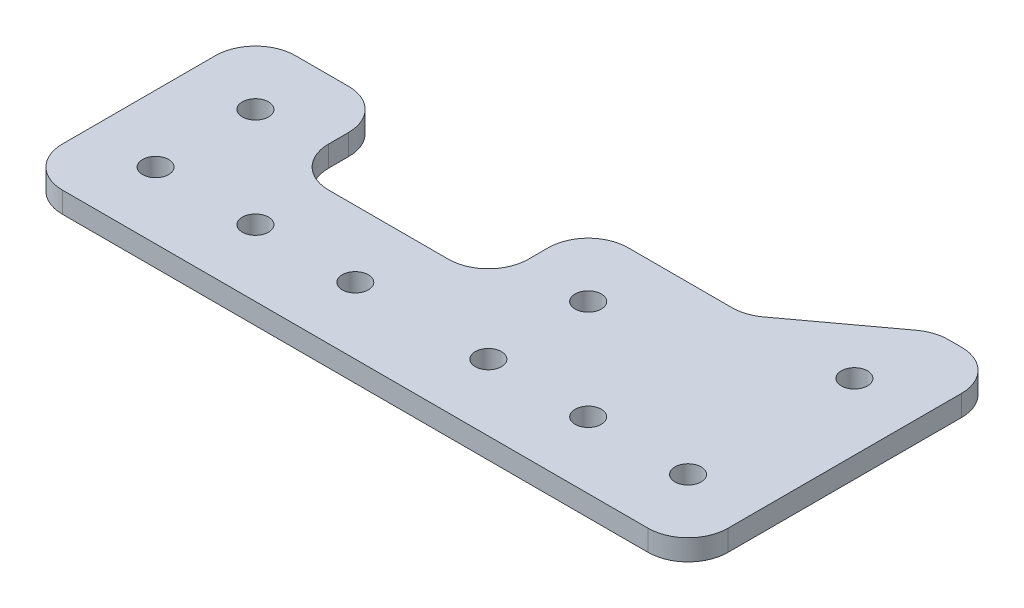
ISO-10303-21;
HEADER;
FILE_DESCRIPTION(('STEP AP214'),'2;1');
FILE_NAME('part.step','',(''),(''),'','','');
FILE_SCHEMA(('AUTOMOTIVE_DESIGN { 1 0 10303 214 1 1 1 1 }'));
ENDSEC;
DATA;
#1=APPLICATION_CONTEXT('core data for automotive mechanical design processes');
#2=APPLICATION_PROTOCOL_DEFINITION('international standard','automotive_design',2000,#1);
#3=PRODUCT_CONTEXT('',#1,'mechanical');
#4=PRODUCT('Part','Part','',(#3));
#5=PRODUCT_RELATED_PRODUCT_CATEGORY('part','',(#4));
#6=PRODUCT_DEFINITION_FORMATION('','',#4);
#7=PRODUCT_DEFINITION_CONTEXT('part definition',#1,'design');
#8=PRODUCT_DEFINITION('design','',#6,#7);
#9=PRODUCT_DEFINITION_SHAPE('','',#8);
#10=(LENGTH_UNIT() NAMED_UNIT(*) SI_UNIT(.MILLI.,.METRE.));
#11=(NAMED_UNIT(*) PLANE_ANGLE_UNIT() SI_UNIT($,.RADIAN.));
#12=(NAMED_UNIT(*) SI_UNIT($,.STERADIAN.) SOLID_ANGLE_UNIT());
#13=UNCERTAINTY_MEASURE_WITH_UNIT(LENGTH_MEASURE(1.E-05),#10,'distance_accuracy_value','');
#14=(GEOMETRIC_REPRESENTATION_CONTEXT(3) GLOBAL_UNCERTAINTY_ASSIGNED_CONTEXT((#13)) GLOBAL_UNIT_ASSIGNED_CONTEXT((#10,
#11,#12)) REPRESENTATION_CONTEXT('',''));
#15=CARTESIAN_POINT('',(0.,0.,0.));
#16=DIRECTION('',(0.,0.,1.));
#17=DIRECTION('',(1.,0.,0.));
#18=AXIS2_PLACEMENT_3D('',#15,#16,#17);
#19=CARTESIAN_POINT('',(1.00323177257206E-12,29.3999999999989,304.8));
#20=DIRECTION('',(0.,0.,-1.));
#21=DIRECTION('',(-1.,0.,0.));
#22=AXIS2_PLACEMENT_3D('',#19,#20,#21);
#23=PLANE('',#22);
#24=DIRECTION('',(1.,0.,0.));
#25=VECTOR('',#24,1.);
#26=CARTESIAN_POINT('',(1.01719769792743E-12,25.3999999999989,304.8));
#27=LINE('',#26,#25);
#28=CARTESIAN_POINT('',(-182.879999999999,25.3999999999983,304.800000000001));
#29=VERTEX_POINT('',#28);
#30=CARTESIAN_POINT('',(-71.119999999999,25.3999999999987,304.8));
#31=VERTEX_POINT('',#30);
#32=EDGE_CURVE('E366',#29,#31,#27,.T.);
#33=ORIENTED_EDGE('',*,*,#32,.T.);
#34=DIRECTION('',(0.,-1.,0.));
#35=VECTOR('',#34,1.);
#36=CARTESIAN_POINT('',(-71.119999999999,29.3999999999987,304.8));
#37=LINE('',#36,#35);
#38=CARTESIAN_POINT('',(-71.119999999999,29.3999999999987,304.8));
#39=VERTEX_POINT('',#38);
#40=EDGE_CURVE('E184',#31,#39,#37,.F.);
#41=ORIENTED_EDGE('',*,*,#40,.T.);
#42=DIRECTION('',(1.,0.,0.));
#43=VECTOR('',#42,1.);
#44=CARTESIAN_POINT('',(1.00323177257206E-12,29.3999999999989,304.8));
#45=LINE('',#44,#43);
#46=CARTESIAN_POINT('',(-182.879999999999,29.3999999999983,304.800000000001));
#47=VERTEX_POINT('',#46);
#48=EDGE_CURVE('E476',#47,#39,#45,.T.);
#49=ORIENTED_EDGE('',*,*,#48,.F.);
#50=DIRECTION('',(0.,-1.,0.));
#51=VECTOR('',#50,1.);
#52=CARTESIAN_POINT('',(-182.879999999999,29.3999999999983,304.800000000001));
#53=LINE('',#52,#51);
#54=EDGE_CURVE('E287',#47,#29,#53,.T.);
#55=ORIENTED_EDGE('',*,*,#54,.T.);
#56=EDGE_LOOP('',(#33,#41,#49,#55));
#57=FACE_BOUND('',#56,.T.);
#58=ADVANCED_FACE('F35',(#57),#23,.F.);
#59=CARTESIAN_POINT('',(-63.4999999999991,29.3999999999998,1.02605102930766E-13));
#60=DIRECTION('',(-1.,0.,0.));
#61=DIRECTION('',(0.,-1.,0.));
#62=AXIS2_PLACEMENT_3D('',#59,#60,#61);
#63=PLANE('',#62);
#64=DIRECTION('',(0.,0.,-1.));
#65=VECTOR('',#64,1.);
#66=CARTESIAN_POINT('',(-63.4999999999991,25.3999999999998,0.));
#67=LINE('',#66,#65);
#68=CARTESIAN_POINT('',(-63.4999999999991,25.3999999999987,297.18));
#69=VERTEX_POINT('',#68);
#70=CARTESIAN_POINT('',(-63.4999999999991,25.3999999999989,252.604139980439));
#71=VERTEX_POINT('',#70);
#72=EDGE_CURVE('E369',#69,#71,#67,.T.);
#73=ORIENTED_EDGE('',*,*,#72,.T.);
#74=DIRECTION('',(0.,-1.,0.));
#75=VECTOR('',#74,1.);
#76=CARTESIAN_POINT('',(-63.4999999999991,29.3999999999989,252.604139980439));
#77=LINE('',#76,#75);
#78=CARTESIAN_POINT('',(-63.4999999999991,29.3999999999989,252.604139980439));
#79=VERTEX_POINT('',#78);
#80=EDGE_CURVE('E271',#71,#79,#77,.F.);
#81=ORIENTED_EDGE('',*,*,#80,.T.);
#82=DIRECTION('',(0.,0.,-1.));
#83=VECTOR('',#82,1.);
#84=CARTESIAN_POINT('',(-63.4999999999991,29.3999999999998,1.02605102930766E-13));
#85=LINE('',#84,#83);
#86=CARTESIAN_POINT('',(-63.4999999999991,29.3999999999987,297.18));
#87=VERTEX_POINT('',#86);
#88=EDGE_CURVE('E473',#87,#79,#85,.T.);
#89=ORIENTED_EDGE('',*,*,#88,.F.);
#90=DIRECTION('',(0.,-1.,0.));
#91=VECTOR('',#90,1.);
#92=CARTESIAN_POINT('',(-63.4999999999991,29.3999999999987,297.18));
#93=LINE('',#92,#91);
#94=EDGE_CURVE('E268',#87,#69,#93,.T.);
#95=ORIENTED_EDGE('',*,*,#94,.T.);
#96=EDGE_LOOP('',(#73,#81,#89,#95));
#97=FACE_BOUND('',#96,.T.);
#98=ADVANCED_FACE('F398',(#97),#63,.F.);
#99=CARTESIAN_POINT('',(-1.02605102930764E-13,29.3999999999991,244.984139980439));
#100=DIRECTION('',(0.,0.,-1.));
#101=DIRECTION('',(0.,1.,0.));
#102=AXIS2_PLACEMENT_3D('',#99,#100,#101);
#103=PLANE('',#102);
#104=DIRECTION('',(1.,0.,0.));
#105=VECTOR('',#104,1.);
#106=CARTESIAN_POINT('',(0.,25.3999999999991,244.984139980439));
#107=LINE('',#106,#105);
#108=CARTESIAN_POINT('',(-73.6941096602435,25.3999999999989,244.984139980439));
#109=VERTEX_POINT('',#108);
#110=CARTESIAN_POINT('',(-71.1199999999991,25.3999999999989,244.984139980439));
#111=VERTEX_POINT('',#110);
#112=EDGE_CURVE('E308',#109,#111,#107,.T.);
#113=ORIENTED_EDGE('',*,*,#112,.F.);
#114=DIRECTION('',(0.,-1.,0.));
#115=VECTOR('',#114,1.);
#116=CARTESIAN_POINT('',(-73.6941096602435,29.3999999999989,244.984139980439));
#117=LINE('',#116,#115);
#118=CARTESIAN_POINT('',(-73.6941096602435,29.3999999999989,244.984139980439));
#119=VERTEX_POINT('',#118);
#120=EDGE_CURVE('E253',#109,#119,#117,.F.);
#121=ORIENTED_EDGE('',*,*,#120,.T.);
#122=DIRECTION('',(1.,0.,0.));
#123=VECTOR('',#122,1.);
#124=CARTESIAN_POINT('',(-1.02605102930764E-13,29.3999999999991,244.984139980439));
#125=LINE('',#124,#123);
#126=CARTESIAN_POINT('',(-71.1199999999991,29.3999999999989,244.984139980439));
#127=VERTEX_POINT('',#126);
#128=EDGE_CURVE('E328',#119,#127,#125,.T.);
#129=ORIENTED_EDGE('',*,*,#128,.T.);
#130=DIRECTION('',(0.,-1.,0.));
#131=VECTOR('',#130,1.);
#132=CARTESIAN_POINT('',(-71.1199999999991,25.3999999999989,244.984139980439));
#133=LINE('',#132,#131);
#134=EDGE_CURVE('E250',#127,#111,#133,.T.);
#135=ORIENTED_EDGE('',*,*,#134,.T.);
#136=EDGE_LOOP('',(#113,#121,#129,#135));
#137=FACE_BOUND('',#136,.T.);
#138=ADVANCED_FACE('F404',(#137),#103,.T.);
#139=CARTESIAN_POINT('',(90.1804497914189,29.3999999999999,122.283715004447));
#140=DIRECTION('',(-0.593525988522105,0.,-0.804814824011622));
#141=DIRECTION('',(-0.804814824011622,0.,0.593525988522105));
#142=AXIS2_PLACEMENT_3D('',#139,#140,#141);
#143=PLANE('',#142);
#144=DIRECTION('',(0.804814824011622,0.,-0.593525988522106));
#145=VECTOR('',#144,1.);
#146=CARTESIAN_POINT('',(90.1804497914189,29.3999999999999,122.283715004447));
#147=LINE('',#146,#145);
#148=CARTESIAN_POINT('',(-95.0191623782209,29.3999999999988,258.862688958968));
#149=VERTEX_POINT('',#148);
#150=CARTESIAN_POINT('',(-78.216777692782,29.3999999999989,246.47145102147));
#151=VERTEX_POINT('',#150);
#152=EDGE_CURVE('E319',#149,#151,#147,.T.);
#153=ORIENTED_EDGE('',*,*,#152,.T.);
#154=DIRECTION('',(0.,-1.,0.));
#155=VECTOR('',#154,1.);
#156=CARTESIAN_POINT('',(-78.216777692782,29.3999999999989,246.47145102147));
#157=LINE('',#156,#155);
#158=CARTESIAN_POINT('',(-78.216777692782,25.3999999999989,246.47145102147));
#159=VERTEX_POINT('',#158);
#160=EDGE_CURVE('E234',#151,#159,#157,.T.);
#161=ORIENTED_EDGE('',*,*,#160,.T.);
#162=DIRECTION('',(0.804814824011622,0.,-0.593525988522106));
#163=VECTOR('',#162,1.);
#164=CARTESIAN_POINT('',(90.1804497914189,25.3999999999999,122.283715004447));
#165=LINE('',#164,#163);
#166=CARTESIAN_POINT('',(-95.0191623782209,25.3999999999988,258.862688958968));
#167=VERTEX_POINT('',#166);
#168=EDGE_CURVE('E297',#167,#159,#165,.T.);
#169=ORIENTED_EDGE('',*,*,#168,.F.);
#170=DIRECTION('',(0.,-1.,0.));
#171=VECTOR('',#170,1.);
#172=CARTESIAN_POINT('',(-95.0191623782209,29.3999999999987,258.862688958968));
#173=LINE('',#172,#171);
#174=EDGE_CURVE('E232',#167,#149,#173,.F.);
#175=ORIENTED_EDGE('',*,*,#174,.T.);
#176=EDGE_LOOP('',(#153,#161,#169,#175));
#177=FACE_BOUND('',#176,.T.);
#178=ADVANCED_FACE('F305',(#177),#143,.T.);
#179=CARTESIAN_POINT('',(3.79716994185066E-13,29.3999999999991,260.35));
#180=DIRECTION('',(0.,0.,-1.));
#181=DIRECTION('',(0.,1.,0.));
#182=AXIS2_PLACEMENT_3D('',#179,#180,#181);
#183=PLANE('',#182);
#184=DIRECTION('',(1.,0.,0.));
#185=VECTOR('',#184,1.);
#186=CARTESIAN_POINT('',(3.79716994185066E-13,29.3999999999991,260.35));
#187=LINE('',#186,#185);
#188=CARTESIAN_POINT('',(-119.38,29.3999999999987,260.35));
#189=VERTEX_POINT('',#188);
#190=CARTESIAN_POINT('',(-99.5418304107593,29.3999999999987,260.35));
#191=VERTEX_POINT('',#190);
#192=EDGE_CURVE('E317',#189,#191,#187,.T.);
#193=ORIENTED_EDGE('',*,*,#192,.T.);
#194=DIRECTION('',(0.,-1.,0.));
#195=VECTOR('',#194,1.);
#196=CARTESIAN_POINT('',(-99.5418304107593,25.3999999999987,260.35));
#197=LINE('',#196,#195);
#198=CARTESIAN_POINT('',(-99.5418304107593,25.3999999999987,260.35));
#199=VERTEX_POINT('',#198);
#200=EDGE_CURVE('E275',#191,#199,#197,.T.);
#201=ORIENTED_EDGE('',*,*,#200,.T.);
#202=DIRECTION('',(1.,0.,0.));
#203=VECTOR('',#202,1.);
#204=CARTESIAN_POINT('',(3.93682919540439E-13,25.3999999999991,260.35));
#205=LINE('',#204,#203);
#206=CARTESIAN_POINT('',(-119.38,25.3999999999987,260.35));
#207=VERTEX_POINT('',#206);
#208=EDGE_CURVE('E299',#207,#199,#205,.T.);
#209=ORIENTED_EDGE('',*,*,#208,.F.);
#210=DIRECTION('',(0.,-1.,0.));
#211=VECTOR('',#210,1.);
#212=CARTESIAN_POINT('',(-119.38,29.3999999999987,260.35));
#213=LINE('',#212,#211);
#214=EDGE_CURVE('E273',#207,#189,#213,.F.);
#215=ORIENTED_EDGE('',*,*,#214,.T.);
#216=EDGE_LOOP('',(#193,#201,#209,#215));
#217=FACE_BOUND('',#216,.T.);
#218=ADVANCED_FACE('F321',(#217),#183,.T.);
#219=CARTESIAN_POINT('',(-127.,29.3999999999995,0.));
#220=DIRECTION('',(1.,0.,0.));
#221=DIRECTION('',(0.,1.,0.));
#222=AXIS2_PLACEMENT_3D('',#219,#220,#221);
#223=PLANE('',#222);
#224=DIRECTION('',(0.,0.,1.));
#225=VECTOR('',#224,1.);
#226=CARTESIAN_POINT('',(-127.,25.3999999999995,0.));
#227=LINE('',#226,#225);
#228=CARTESIAN_POINT('',(-127.,25.3999999999986,267.97));
#229=VERTEX_POINT('',#228);
#230=CARTESIAN_POINT('',(-127.,25.3999999999986,271.78));
#231=VERTEX_POINT('',#230);
#232=EDGE_CURVE('E207',#229,#231,#227,.T.);
#233=ORIENTED_EDGE('',*,*,#232,.T.);
#234=DIRECTION('',(0.,-1.,0.));
#235=VECTOR('',#234,1.);
#236=CARTESIAN_POINT('',(-127.,29.3999999999986,271.78));
#237=LINE('',#236,#235);
#238=CARTESIAN_POINT('',(-127.,29.3999999999986,271.78));
#239=VERTEX_POINT('',#238);
#240=EDGE_CURVE('E230',#231,#239,#237,.F.);
#241=ORIENTED_EDGE('',*,*,#240,.T.);
#242=DIRECTION('',(0.,0.,1.));
#243=VECTOR('',#242,1.);
#244=CARTESIAN_POINT('',(-127.,29.3999999999995,0.));
#245=LINE('',#244,#243);
#246=CARTESIAN_POINT('',(-127.,29.3999999999986,267.97));
#247=VERTEX_POINT('',#246);
#248=EDGE_CURVE('E323',#247,#239,#245,.T.);
#249=ORIENTED_EDGE('',*,*,#248,.F.);
#250=DIRECTION('',(0.,-1.,0.));
#251=VECTOR('',#250,1.);
#252=CARTESIAN_POINT('',(-127.,25.3999999999986,267.97));
#253=LINE('',#252,#251);
#254=EDGE_CURVE('E227',#247,#229,#253,.T.);
#255=ORIENTED_EDGE('',*,*,#254,.T.);
#256=EDGE_LOOP('',(#233,#241,#249,#255));
#257=FACE_BOUND('',#256,.T.);
#258=ADVANCED_FACE('F378',(#257),#223,.F.);
#259=CARTESIAN_POINT('',(9.11078699613493E-13,29.399999999999,279.4));
#260=DIRECTION('',(0.,0.,1.));
#261=DIRECTION('',(1.,0.,0.));
#262=AXIS2_PLACEMENT_3D('',#259,#260,#261);
#263=PLANE('',#262);
#264=DIRECTION('',(-1.,0.,0.));
#265=VECTOR('',#264,1.);
#266=CARTESIAN_POINT('',(9.25044624968866E-13,25.399999999999,279.4));
#267=LINE('',#266,#265);
#268=CARTESIAN_POINT('',(-134.62,25.3999999999985,279.4));
#269=VERTEX_POINT('',#268);
#270=CARTESIAN_POINT('',(-157.48,25.3999999999985,279.4));
#271=VERTEX_POINT('',#270);
#272=EDGE_CURVE('E203',#269,#271,#267,.T.);
#273=ORIENTED_EDGE('',*,*,#272,.T.);
#274=DIRECTION('',(0.,-1.,0.));
#275=VECTOR('',#274,1.);
#276=CARTESIAN_POINT('',(-157.48,29.3999999999985,279.4));
#277=LINE('',#276,#275);
#278=CARTESIAN_POINT('',(-157.48,29.3999999999985,279.4));
#279=VERTEX_POINT('',#278);
#280=EDGE_CURVE('E178',#271,#279,#277,.F.);
#281=ORIENTED_EDGE('',*,*,#280,.T.);
#282=DIRECTION('',(-1.,0.,0.));
#283=VECTOR('',#282,1.);
#284=CARTESIAN_POINT('',(9.11078699613493E-13,29.399999999999,279.4));
#285=LINE('',#284,#283);
#286=CARTESIAN_POINT('',(-134.62,29.3999999999985,279.4));
#287=VERTEX_POINT('',#286);
#288=EDGE_CURVE('E326',#287,#279,#285,.T.);
#289=ORIENTED_EDGE('',*,*,#288,.F.);
#290=DIRECTION('',(0.,-1.,0.));
#291=VECTOR('',#290,1.);
#292=CARTESIAN_POINT('',(-134.62,25.3999999999985,279.4));
#293=LINE('',#292,#291);
#294=EDGE_CURVE('E194',#287,#269,#293,.T.);
#295=ORIENTED_EDGE('',*,*,#294,.T.);
#296=EDGE_LOOP('',(#273,#281,#289,#295));
#297=FACE_BOUND('',#296,.T.);
#298=ADVANCED_FACE('F387',(#297),#263,.F.);
#299=CARTESIAN_POINT('',(-165.1,29.3999999999994,1.02605102930765E-13));
#300=DIRECTION('',(-1.,0.,0.));
#301=DIRECTION('',(0.,-1.,0.));
#302=AXIS2_PLACEMENT_3D('',#299,#300,#301);
#303=PLANE('',#302);
#304=DIRECTION('',(0.,0.,-1.));
#305=VECTOR('',#304,1.);
#306=CARTESIAN_POINT('',(-165.1,29.3999999999994,1.02605102930765E-13));
#307=LINE('',#306,#305);
#308=CARTESIAN_POINT('',(-165.1,29.3999999999985,271.78));
#309=VERTEX_POINT('',#308);
#310=CARTESIAN_POINT('',(-165.1,29.3999999999985,267.97));
#311=VERTEX_POINT('',#310);
#312=EDGE_CURVE('E193',#309,#311,#307,.T.);
#313=ORIENTED_EDGE('',*,*,#312,.F.);
#314=DIRECTION('',(0.,-1.,0.));
#315=VECTOR('',#314,1.);
#316=CARTESIAN_POINT('',(-165.1,25.3999999999985,271.78));
#317=LINE('',#316,#315);
#318=CARTESIAN_POINT('',(-165.1,25.3999999999985,271.78));
#319=VERTEX_POINT('',#318);
#320=EDGE_CURVE('E177',#309,#319,#317,.T.);
#321=ORIENTED_EDGE('',*,*,#320,.T.);
#322=DIRECTION('',(0.,0.,-1.));
#323=VECTOR('',#322,1.);
#324=CARTESIAN_POINT('',(-165.1,25.3999999999994,0.));
#325=LINE('',#324,#323);
#326=CARTESIAN_POINT('',(-165.1,25.3999999999985,267.97));
#327=VERTEX_POINT('',#326);
#328=EDGE_CURVE('E190',#319,#327,#325,.T.);
#329=ORIENTED_EDGE('',*,*,#328,.T.);
#330=DIRECTION('',(0.,-1.,0.));
#331=VECTOR('',#330,1.);
#332=CARTESIAN_POINT('',(-165.1,29.3999999999985,267.97));
#333=LINE('',#332,#331);
#334=EDGE_CURVE('E195',#327,#311,#333,.F.);
#335=ORIENTED_EDGE('',*,*,#334,.T.);
#336=EDGE_LOOP('',(#313,#321,#329,#335));
#337=FACE_BOUND('',#336,.T.);
#338=ADVANCED_FACE('F189',(#337),#303,.F.);
#339=CARTESIAN_POINT('',(4.66384197189641E-13,29.3999999999991,260.35));
#340=DIRECTION('',(0.,0.,-1.));
#341=DIRECTION('',(0.,1.,0.));
#342=AXIS2_PLACEMENT_3D('',#339,#340,#341);
#343=PLANE('',#342);
#344=DIRECTION('',(1.,0.,0.));
#345=VECTOR('',#344,1.);
#346=CARTESIAN_POINT('',(4.80350122545013E-13,25.3999999999991,260.35));
#347=LINE('',#346,#345);
#348=CARTESIAN_POINT('',(-182.879999999999,25.3999999999984,260.35));
#349=VERTEX_POINT('',#348);
#350=CARTESIAN_POINT('',(-172.72,25.3999999999985,260.35));
#351=VERTEX_POINT('',#350);
#352=EDGE_CURVE('E202',#349,#351,#347,.T.);
#353=ORIENTED_EDGE('',*,*,#352,.F.);
#354=DIRECTION('',(0.,-1.,0.));
#355=VECTOR('',#354,1.);
#356=CARTESIAN_POINT('',(-182.879999999999,29.3999999999984,260.35));
#357=LINE('',#356,#355);
#358=CARTESIAN_POINT('',(-182.879999999999,29.3999999999984,260.35));
#359=VERTEX_POINT('',#358);
#360=EDGE_CURVE('E285',#349,#359,#357,.F.);
#361=ORIENTED_EDGE('',*,*,#360,.T.);
#362=DIRECTION('',(1.,0.,0.));
#363=VECTOR('',#362,1.);
#364=CARTESIAN_POINT('',(4.66384197189641E-13,29.3999999999991,260.35));
#365=LINE('',#364,#363);
#366=CARTESIAN_POINT('',(-172.72,29.3999999999985,260.35));
#367=VERTEX_POINT('',#366);
#368=EDGE_CURVE('E335',#359,#367,#365,.T.);
#369=ORIENTED_EDGE('',*,*,#368,.T.);
#370=DIRECTION('',(0.,-1.,0.));
#371=VECTOR('',#370,1.);
#372=CARTESIAN_POINT('',(-172.72,25.3999999999985,260.35));
#373=LINE('',#372,#371);
#374=EDGE_CURVE('E282',#367,#351,#373,.T.);
#375=ORIENTED_EDGE('',*,*,#374,.T.);
#376=EDGE_LOOP('',(#353,#361,#369,#375));
#377=FACE_BOUND('',#376,.T.);
#378=ADVANCED_FACE('F394',(#377),#343,.T.);
#379=CARTESIAN_POINT('',(-76.2000000000002,29.3999999999988,260.35));
#380=DIRECTION('',(0.,-1.,0.));
#381=DIRECTION('',(1.,0.,0.));
#382=AXIS2_PLACEMENT_3D('',#379,#380,#381);
#383=CYLINDRICAL_SURFACE('',#382,2.5);
#384=CARTESIAN_POINT('',(-76.2000000000002,29.3999999999988,260.35));
#385=DIRECTION('',(0.,1.,0.));
#386=DIRECTION('',(0.,0.,1.));
#387=AXIS2_PLACEMENT_3D('',#384,#385,#386);
#388=CIRCLE('',#387,2.5);
#389=CARTESIAN_POINT('',(-76.2000000000002,29.3999999999988,262.85));
#390=VERTEX_POINT('',#389);
#391=EDGE_CURVE('E343',#390,#390,#388,.T.);
#392=ORIENTED_EDGE('',*,*,#391,.T.);
#393=EDGE_LOOP('',(#392));
#394=FACE_BOUND('',#393,.T.);
#395=CARTESIAN_POINT('',(-76.2000000000002,25.3999999999988,260.35));
#396=DIRECTION('',(0.,1.,0.));
#397=DIRECTION('',(0.,0.,1.));
#398=AXIS2_PLACEMENT_3D('',#395,#396,#397);
#399=CIRCLE('',#398,2.5);
#400=CARTESIAN_POINT('',(-76.2000000000002,25.3999999999988,262.85));
#401=VERTEX_POINT('',#400);
#402=EDGE_CURVE('E215',#401,#401,#399,.T.);
#403=ORIENTED_EDGE('',*,*,#402,.F.);
#404=EDGE_LOOP('',(#403));
#405=FACE_BOUND('',#404,.T.);
#406=ADVANCED_FACE('F527',(#394,#405),#383,.F.);
#407=CARTESIAN_POINT('',(-177.8,29.3999999999984,273.05));
#408=DIRECTION('',(0.,-1.,0.));
#409=DIRECTION('',(1.,0.,0.));
#410=AXIS2_PLACEMENT_3D('',#407,#408,#409);
#411=CYLINDRICAL_SURFACE('',#410,2.5);
#412=CARTESIAN_POINT('',(-177.8,29.3999999999984,273.05));
#413=DIRECTION('',(0.,1.,0.));
#414=DIRECTION('',(0.,0.,1.));
#415=AXIS2_PLACEMENT_3D('',#412,#413,#414);
#416=CIRCLE('',#415,2.5);
#417=CARTESIAN_POINT('',(-177.8,29.3999999999984,275.55));
#418=VERTEX_POINT('',#417);
#419=EDGE_CURVE('E340',#418,#418,#416,.T.);
#420=ORIENTED_EDGE('',*,*,#419,.T.);
#421=EDGE_LOOP('',(#420));
#422=FACE_BOUND('',#421,.T.);
#423=CARTESIAN_POINT('',(-177.8,25.3999999999984,273.05));
#424=DIRECTION('',(0.,1.,0.));
#425=DIRECTION('',(0.,0.,1.));
#426=AXIS2_PLACEMENT_3D('',#423,#424,#425);
#427=CIRCLE('',#426,2.5);
#428=CARTESIAN_POINT('',(-177.8,25.3999999999984,275.55));
#429=VERTEX_POINT('',#428);
#430=EDGE_CURVE('E212',#429,#429,#427,.T.);
#431=ORIENTED_EDGE('',*,*,#430,.F.);
#432=EDGE_LOOP('',(#431));
#433=FACE_BOUND('',#432,.T.);
#434=ADVANCED_FACE('F530',(#422,#433),#411,.F.);
#435=CARTESIAN_POINT('',(-190.5,29.3999999999993,7.93753150120034E-13));
#436=DIRECTION('',(1.,0.,0.));
#437=DIRECTION('',(0.,0.,-1.));
#438=AXIS2_PLACEMENT_3D('',#435,#436,#437);
#439=PLANE('',#438);
#440=DIRECTION('',(0.,0.,1.));
#441=VECTOR('',#440,1.);
#442=CARTESIAN_POINT('',(-190.5,29.3999999999993,7.93753150120034E-13));
#443=LINE('',#442,#441);
#444=CARTESIAN_POINT('',(-190.499999999999,29.3999999999984,267.97));
#445=VERTEX_POINT('',#444);
#446=CARTESIAN_POINT('',(-190.499999999999,29.3999999999983,297.180000000001));
#447=VERTEX_POINT('',#446);
#448=EDGE_CURVE('E338',#445,#447,#443,.T.);
#449=ORIENTED_EDGE('',*,*,#448,.F.);
#450=DIRECTION('',(0.,-1.,0.));
#451=VECTOR('',#450,1.);
#452=CARTESIAN_POINT('',(-190.499999999999,25.3999999999984,267.97));
#453=LINE('',#452,#451);
#454=CARTESIAN_POINT('',(-190.499999999999,25.3999999999984,267.97));
#455=VERTEX_POINT('',#454);
#456=EDGE_CURVE('E279',#445,#455,#453,.T.);
#457=ORIENTED_EDGE('',*,*,#456,.T.);
#458=DIRECTION('',(0.,0.,1.));
#459=VECTOR('',#458,1.);
#460=CARTESIAN_POINT('',(-190.5,25.3999999999993,7.79787224764662E-13));
#461=LINE('',#460,#459);
#462=CARTESIAN_POINT('',(-190.499999999999,25.3999999999983,297.180000000001));
#463=VERTEX_POINT('',#462);
#464=EDGE_CURVE('E205',#455,#463,#461,.T.);
#465=ORIENTED_EDGE('',*,*,#464,.T.);
#466=DIRECTION('',(0.,-1.,0.));
#467=VECTOR('',#466,1.);
#468=CARTESIAN_POINT('',(-190.499999999999,29.3999999999983,297.180000000001));
#469=LINE('',#468,#467);
#470=EDGE_CURVE('E50',#463,#447,#469,.F.);
#471=ORIENTED_EDGE('',*,*,#470,.T.);
#472=EDGE_LOOP('',(#449,#457,#465,#471));
#473=FACE_BOUND('',#472,.T.);
#474=ADVANCED_FACE('F413',(#473),#439,.F.);
#475=CARTESIAN_POINT('',(-114.3,29.3999999999986,292.1));
#476=DIRECTION('',(0.,-1.,0.));
#477=DIRECTION('',(1.,0.,0.));
#478=AXIS2_PLACEMENT_3D('',#475,#476,#477);
#479=CYLINDRICAL_SURFACE('',#478,2.50000000000001);
#480=CARTESIAN_POINT('',(-114.3,29.3999999999986,292.1));
#481=DIRECTION('',(0.,1.,0.));
#482=DIRECTION('',(0.,0.,1.));
#483=AXIS2_PLACEMENT_3D('',#480,#481,#482);
#484=CIRCLE('',#483,2.50000000000001);
#485=CARTESIAN_POINT('',(-114.3,29.3999999999986,294.6));
#486=VERTEX_POINT('',#485);
#487=EDGE_CURVE('E481',#486,#486,#484,.T.);
#488=ORIENTED_EDGE('',*,*,#487,.T.);
#489=EDGE_LOOP('',(#488));
#490=FACE_BOUND('',#489,.T.);
#491=CARTESIAN_POINT('',(-114.3,25.3999999999986,292.1));
#492=DIRECTION('',(0.,1.,0.));
#493=DIRECTION('',(0.,0.,1.));
#494=AXIS2_PLACEMENT_3D('',#491,#492,#493);
#495=CIRCLE('',#494,2.50000000000001);
#496=CARTESIAN_POINT('',(-114.3,25.3999999999986,294.6));
#497=VERTEX_POINT('',#496);
#498=EDGE_CURVE('E363',#497,#497,#495,.T.);
#499=ORIENTED_EDGE('',*,*,#498,.F.);
#500=EDGE_LOOP('',(#499));
#501=FACE_BOUND('',#500,.T.);
#502=ADVANCED_FACE('F409',(#490,#501),#479,.F.);
#503=CARTESIAN_POINT('',(-177.8,29.3999999999983,292.1));
#504=DIRECTION('',(0.,-1.,0.));
#505=DIRECTION('',(1.,0.,0.));
#506=AXIS2_PLACEMENT_3D('',#503,#504,#505);
#507=CYLINDRICAL_SURFACE('',#506,2.5);
#508=CARTESIAN_POINT('',(-177.8,29.3999999999983,292.1));
#509=DIRECTION('',(0.,1.,0.));
#510=DIRECTION('',(0.,0.,1.));
#511=AXIS2_PLACEMENT_3D('',#508,#509,#510);
#512=CIRCLE('',#511,2.5);
#513=CARTESIAN_POINT('',(-177.8,29.3999999999983,294.6));
#514=VERTEX_POINT('',#513);
#515=EDGE_CURVE('E486',#514,#514,#512,.T.);
#516=ORIENTED_EDGE('',*,*,#515,.T.);
#517=EDGE_LOOP('',(#516));
#518=FACE_BOUND('',#517,.T.);
#519=CARTESIAN_POINT('',(-177.8,25.3999999999983,292.1));
#520=DIRECTION('',(0.,1.,0.));
#521=DIRECTION('',(0.,0.,1.));
#522=AXIS2_PLACEMENT_3D('',#519,#520,#521);
#523=CIRCLE('',#522,2.5);
#524=CARTESIAN_POINT('',(-177.8,25.3999999999983,294.6));
#525=VERTEX_POINT('',#524);
#526=EDGE_CURVE('E360',#525,#525,#523,.T.);
#527=ORIENTED_EDGE('',*,*,#526,.F.);
#528=EDGE_LOOP('',(#527));
#529=FACE_BOUND('',#528,.T.);
#530=ADVANCED_FACE('F412',(#518,#529),#507,.F.);
#531=CARTESIAN_POINT('',(-158.75,29.3999999999984,292.1));
#532=DIRECTION('',(0.,-1.,0.));
#533=DIRECTION('',(1.,0.,0.));
#534=AXIS2_PLACEMENT_3D('',#531,#532,#533);
#535=CYLINDRICAL_SURFACE('',#534,2.5);
#536=CARTESIAN_POINT('',(-158.75,29.3999999999984,292.1));
#537=DIRECTION('',(0.,1.,0.));
#538=DIRECTION('',(0.,0.,1.));
#539=AXIS2_PLACEMENT_3D('',#536,#537,#538);
#540=CIRCLE('',#539,2.5);
#541=CARTESIAN_POINT('',(-158.75,29.3999999999984,294.6));
#542=VERTEX_POINT('',#541);
#543=EDGE_CURVE('E489',#542,#542,#540,.T.);
#544=ORIENTED_EDGE('',*,*,#543,.T.);
#545=EDGE_LOOP('',(#544));
#546=FACE_BOUND('',#545,.T.);
#547=CARTESIAN_POINT('',(-158.75,25.3999999999984,292.1));
#548=DIRECTION('',(0.,1.,0.));
#549=DIRECTION('',(0.,0.,1.));
#550=AXIS2_PLACEMENT_3D('',#547,#548,#549);
#551=CIRCLE('',#550,2.5);
#552=CARTESIAN_POINT('',(-158.75,25.3999999999984,294.6));
#553=VERTEX_POINT('',#552);
#554=EDGE_CURVE('E357',#553,#553,#551,.T.);
#555=ORIENTED_EDGE('',*,*,#554,.F.);
#556=EDGE_LOOP('',(#555));
#557=FACE_BOUND('',#556,.T.);
#558=ADVANCED_FACE('F417',(#546,#557),#535,.F.);
#559=CARTESIAN_POINT('',(-95.2500000000001,29.3999999999986,292.1));
#560=DIRECTION('',(0.,-1.,0.));
#561=DIRECTION('',(1.,0.,0.));
#562=AXIS2_PLACEMENT_3D('',#559,#560,#561);
#563=CYLINDRICAL_SURFACE('',#562,2.50000000000001);
#564=CARTESIAN_POINT('',(-95.2500000000001,29.3999999999986,292.1));
#565=DIRECTION('',(0.,1.,0.));
#566=DIRECTION('',(0.,0.,1.));
#567=AXIS2_PLACEMENT_3D('',#564,#565,#566);
#568=CIRCLE('',#567,2.50000000000001);
#569=CARTESIAN_POINT('',(-95.2500000000001,29.3999999999986,294.6));
#570=VERTEX_POINT('',#569);
#571=EDGE_CURVE('E492',#570,#570,#568,.T.);
#572=ORIENTED_EDGE('',*,*,#571,.T.);
#573=EDGE_LOOP('',(#572));
#574=FACE_BOUND('',#573,.T.);
#575=CARTESIAN_POINT('',(-95.2500000000001,25.3999999999986,292.1));
#576=DIRECTION('',(0.,1.,0.));
#577=DIRECTION('',(0.,0.,1.));
#578=AXIS2_PLACEMENT_3D('',#575,#576,#577);
#579=CIRCLE('',#578,2.50000000000001);
#580=CARTESIAN_POINT('',(-95.2500000000001,25.3999999999986,294.6));
#581=VERTEX_POINT('',#580);
#582=EDGE_CURVE('E354',#581,#581,#579,.T.);
#583=ORIENTED_EDGE('',*,*,#582,.F.);
#584=EDGE_LOOP('',(#583));
#585=FACE_BOUND('',#584,.T.);
#586=ADVANCED_FACE('F421',(#574,#585),#563,.F.);
#587=CARTESIAN_POINT('',(-139.7,29.3999999999985,292.1));
#588=DIRECTION('',(0.,-1.,0.));
#589=DIRECTION('',(1.,0.,0.));
#590=AXIS2_PLACEMENT_3D('',#587,#588,#589);
#591=CYLINDRICAL_SURFACE('',#590,2.5);
#592=CARTESIAN_POINT('',(-139.7,29.3999999999985,292.1));
#593=DIRECTION('',(0.,1.,0.));
#594=DIRECTION('',(0.,0.,1.));
#595=AXIS2_PLACEMENT_3D('',#592,#593,#594);
#596=CIRCLE('',#595,2.5);
#597=CARTESIAN_POINT('',(-139.7,29.3999999999985,294.6));
#598=VERTEX_POINT('',#597);
#599=EDGE_CURVE('E495',#598,#598,#596,.T.);
#600=ORIENTED_EDGE('',*,*,#599,.T.);
#601=EDGE_LOOP('',(#600));
#602=FACE_BOUND('',#601,.T.);
#603=CARTESIAN_POINT('',(-139.7,25.3999999999985,292.1));
#604=DIRECTION('',(0.,1.,0.));
#605=DIRECTION('',(0.,0.,1.));
#606=AXIS2_PLACEMENT_3D('',#603,#604,#605);
#607=CIRCLE('',#606,2.5);
#608=CARTESIAN_POINT('',(-139.7,25.3999999999985,294.6));
#609=VERTEX_POINT('',#608);
#610=EDGE_CURVE('E351',#609,#609,#607,.T.);
#611=ORIENTED_EDGE('',*,*,#610,.F.);
#612=EDGE_LOOP('',(#611));
#613=FACE_BOUND('',#612,.T.);
#614=ADVANCED_FACE('F425',(#602,#613),#591,.F.);
#615=CARTESIAN_POINT('',(-76.2000000000001,29.3999999999987,292.1));
#616=DIRECTION('',(0.,-1.,0.));
#617=DIRECTION('',(1.,0.,0.));
#618=AXIS2_PLACEMENT_3D('',#615,#616,#617);
#619=CYLINDRICAL_SURFACE('',#618,2.5);
#620=CARTESIAN_POINT('',(-76.2000000000001,29.3999999999987,292.1));
#621=DIRECTION('',(0.,1.,0.));
#622=DIRECTION('',(0.,0.,1.));
#623=AXIS2_PLACEMENT_3D('',#620,#621,#622);
#624=CIRCLE('',#623,2.5);
#625=CARTESIAN_POINT('',(-76.2000000000001,29.3999999999987,294.6));
#626=VERTEX_POINT('',#625);
#627=EDGE_CURVE('E221',#626,#626,#624,.T.);
#628=ORIENTED_EDGE('',*,*,#627,.T.);
#629=EDGE_LOOP('',(#628));
#630=FACE_BOUND('',#629,.T.);
#631=CARTESIAN_POINT('',(-76.2000000000001,25.3999999999987,292.1));
#632=DIRECTION('',(0.,1.,0.));
#633=DIRECTION('',(0.,0.,1.));
#634=AXIS2_PLACEMENT_3D('',#631,#632,#633);
#635=CIRCLE('',#634,2.5);
#636=CARTESIAN_POINT('',(-76.2000000000001,25.3999999999987,294.6));
#637=VERTEX_POINT('',#636);
#638=EDGE_CURVE('E348',#637,#637,#635,.T.);
#639=ORIENTED_EDGE('',*,*,#638,.F.);
#640=EDGE_LOOP('',(#639));
#641=FACE_BOUND('',#640,.T.);
#642=ADVANCED_FACE('F429',(#630,#641),#619,.F.);
#643=CARTESIAN_POINT('',(-114.3,29.3999999999986,273.05));
#644=DIRECTION('',(0.,-1.,0.));
#645=DIRECTION('',(1.,0.,0.));
#646=AXIS2_PLACEMENT_3D('',#643,#644,#645);
#647=CYLINDRICAL_SURFACE('',#646,2.50000000000001);
#648=CARTESIAN_POINT('',(-114.3,29.3999999999986,273.05));
#649=DIRECTION('',(0.,1.,0.));
#650=DIRECTION('',(0.,0.,1.));
#651=AXIS2_PLACEMENT_3D('',#648,#649,#650);
#652=CIRCLE('',#651,2.50000000000001);
#653=CARTESIAN_POINT('',(-114.3,29.3999999999986,275.55));
#654=VERTEX_POINT('',#653);
#655=EDGE_CURVE('E222',#654,#654,#652,.T.);
#656=ORIENTED_EDGE('',*,*,#655,.T.);
#657=EDGE_LOOP('',(#656));
#658=FACE_BOUND('',#657,.T.);
#659=CARTESIAN_POINT('',(-114.3,25.3999999999986,273.05));
#660=DIRECTION('',(0.,1.,0.));
#661=DIRECTION('',(0.,0.,1.));
#662=AXIS2_PLACEMENT_3D('',#659,#660,#661);
#663=CIRCLE('',#662,2.50000000000001);
#664=CARTESIAN_POINT('',(-114.3,25.3999999999986,275.55));
#665=VERTEX_POINT('',#664);
#666=EDGE_CURVE('E218',#665,#665,#663,.T.);
#667=ORIENTED_EDGE('',*,*,#666,.F.);
#668=EDGE_LOOP('',(#667));
#669=FACE_BOUND('',#668,.T.);
#670=ADVANCED_FACE('F433',(#658,#669),#647,.F.);
#671=CARTESIAN_POINT('',(-1.02605102930767E-13,29.4,1.02605102930767E-13));
#672=DIRECTION('',(0.,1.,0.));
#673=DIRECTION('',(0.,0.,1.));
#674=AXIS2_PLACEMENT_3D('',#671,#672,#673);
#675=PLANE('',#674);
#676=ORIENTED_EDGE('',*,*,#627,.F.);
#677=EDGE_LOOP('',(#676));
#678=FACE_BOUND('',#677,.T.);
#679=ORIENTED_EDGE('',*,*,#599,.F.);
#680=EDGE_LOOP('',(#679));
#681=FACE_BOUND('',#680,.T.);
#682=ORIENTED_EDGE('',*,*,#571,.F.);
#683=EDGE_LOOP('',(#682));
#684=FACE_BOUND('',#683,.T.);
#685=ORIENTED_EDGE('',*,*,#543,.F.);
#686=EDGE_LOOP('',(#685));
#687=FACE_BOUND('',#686,.T.);
#688=ORIENTED_EDGE('',*,*,#515,.F.);
#689=EDGE_LOOP('',(#688));
#690=FACE_BOUND('',#689,.T.);
#691=ORIENTED_EDGE('',*,*,#487,.F.);
#692=EDGE_LOOP('',(#691));
#693=FACE_BOUND('',#692,.T.);
#694=ORIENTED_EDGE('',*,*,#128,.F.);
#695=CARTESIAN_POINT('',(-73.6941096602435,29.3999999999988,252.604139980439));
#696=DIRECTION('',(0.,1.,0.));
#697=DIRECTION('',(0.,0.,1.));
#698=AXIS2_PLACEMENT_3D('',#695,#696,#697);
#699=CIRCLE('',#698,7.62);
#700=EDGE_CURVE('E266',#119,#151,#699,.T.);
#701=ORIENTED_EDGE('',*,*,#700,.T.);
#702=ORIENTED_EDGE('',*,*,#152,.F.);
#703=CARTESIAN_POINT('',(-99.5418304107593,29.3999999999988,252.73));
#704=DIRECTION('',(0.,1.,0.));
#705=DIRECTION('',(0.,0.,1.));
#706=AXIS2_PLACEMENT_3D('',#703,#704,#705);
#707=CIRCLE('',#706,7.62);
#708=EDGE_CURVE('E11',#149,#191,#707,.F.);
#709=ORIENTED_EDGE('',*,*,#708,.T.);
#710=ORIENTED_EDGE('',*,*,#192,.F.);
#711=CARTESIAN_POINT('',(-119.38,29.3999999999986,267.97));
#712=DIRECTION('',(0.,1.,0.));
#713=DIRECTION('',(0.,0.,1.));
#714=AXIS2_PLACEMENT_3D('',#711,#712,#713);
#715=CIRCLE('',#714,7.62);
#716=EDGE_CURVE('E259',#189,#247,#715,.T.);
#717=ORIENTED_EDGE('',*,*,#716,.T.);
#718=ORIENTED_EDGE('',*,*,#248,.T.);
#719=CARTESIAN_POINT('',(-134.62,29.3999999999986,271.78));
#720=DIRECTION('',(0.,1.,0.));
#721=DIRECTION('',(0.,0.,1.));
#722=AXIS2_PLACEMENT_3D('',#719,#720,#721);
#723=CIRCLE('',#722,7.62);
#724=EDGE_CURVE('E294',#239,#287,#723,.F.);
#725=ORIENTED_EDGE('',*,*,#724,.T.);
#726=ORIENTED_EDGE('',*,*,#288,.T.);
#727=CARTESIAN_POINT('',(-157.48,29.3999999999985,271.78));
#728=DIRECTION('',(0.,1.,0.));
#729=DIRECTION('',(0.,0.,1.));
#730=AXIS2_PLACEMENT_3D('',#727,#728,#729);
#731=CIRCLE('',#730,7.62);
#732=EDGE_CURVE('E183',#279,#309,#731,.F.);
#733=ORIENTED_EDGE('',*,*,#732,.T.);
#734=ORIENTED_EDGE('',*,*,#312,.T.);
#735=CARTESIAN_POINT('',(-172.72,29.3999999999984,267.97));
#736=DIRECTION('',(0.,1.,0.));
#737=DIRECTION('',(0.,0.,1.));
#738=AXIS2_PLACEMENT_3D('',#735,#736,#737);
#739=CIRCLE('',#738,7.62);
#740=EDGE_CURVE('E261',#311,#367,#739,.T.);
#741=ORIENTED_EDGE('',*,*,#740,.T.);
#742=ORIENTED_EDGE('',*,*,#368,.F.);
#743=CARTESIAN_POINT('',(-182.879999999999,29.3999999999984,267.97));
#744=DIRECTION('',(0.,1.,0.));
#745=DIRECTION('',(0.,0.,1.));
#746=AXIS2_PLACEMENT_3D('',#743,#744,#745);
#747=CIRCLE('',#746,7.62);
#748=EDGE_CURVE('E57',#359,#445,#747,.T.);
#749=ORIENTED_EDGE('',*,*,#748,.T.);
#750=ORIENTED_EDGE('',*,*,#448,.T.);
#751=CARTESIAN_POINT('',(-182.879999999999,29.3999999999983,297.180000000001));
#752=DIRECTION('',(0.,1.,0.));
#753=DIRECTION('',(0.,0.,1.));
#754=AXIS2_PLACEMENT_3D('',#751,#752,#753);
#755=CIRCLE('',#754,7.62);
#756=EDGE_CURVE('E255',#447,#47,#755,.T.);
#757=ORIENTED_EDGE('',*,*,#756,.T.);
#758=ORIENTED_EDGE('',*,*,#48,.T.);
#759=CARTESIAN_POINT('',(-71.1199999999991,29.3999999999987,297.18));
#760=DIRECTION('',(0.,1.,0.));
#761=DIRECTION('',(0.,0.,1.));
#762=AXIS2_PLACEMENT_3D('',#759,#760,#761);
#763=CIRCLE('',#762,7.62);
#764=EDGE_CURVE('E257',#39,#87,#763,.T.);
#765=ORIENTED_EDGE('',*,*,#764,.T.);
#766=ORIENTED_EDGE('',*,*,#88,.T.);
#767=CARTESIAN_POINT('',(-71.1199999999991,29.3999999999989,252.604139980439));
#768=DIRECTION('',(0.,1.,0.));
#769=DIRECTION('',(0.,0.,1.));
#770=AXIS2_PLACEMENT_3D('',#767,#768,#769);
#771=CIRCLE('',#770,7.62);
#772=EDGE_CURVE('E264',#79,#127,#771,.T.);
#773=ORIENTED_EDGE('',*,*,#772,.T.);
#774=EDGE_LOOP('',(#694,#701,#702,#709,#710,#717,#718,#725,#726,#733,#734,#741,#742,#749,#750,
#757,#758,#765,#766,#773));
#775=FACE_BOUND('',#774,.T.);
#776=ORIENTED_EDGE('',*,*,#419,.F.);
#777=EDGE_LOOP('',(#776));
#778=FACE_BOUND('',#777,.T.);
#779=ORIENTED_EDGE('',*,*,#391,.F.);
#780=EDGE_LOOP('',(#779));
#781=FACE_BOUND('',#780,.T.);
#782=ORIENTED_EDGE('',*,*,#655,.F.);
#783=EDGE_LOOP('',(#782));
#784=FACE_BOUND('',#783,.T.);
#785=ADVANCED_FACE('F315',(#678,#681,#684,#687,#690,#693,#775,#778,#781,#784),#675,.T.);
#786=CARTESIAN_POINT('',(0.,25.4,0.));
#787=DIRECTION('',(0.,1.,0.));
#788=DIRECTION('',(0.,0.,1.));
#789=AXIS2_PLACEMENT_3D('',#786,#787,#788);
#790=PLANE('',#789);
#791=ORIENTED_EDGE('',*,*,#638,.T.);
#792=EDGE_LOOP('',(#791));
#793=FACE_BOUND('',#792,.T.);
#794=ORIENTED_EDGE('',*,*,#610,.T.);
#795=EDGE_LOOP('',(#794));
#796=FACE_BOUND('',#795,.T.);
#797=ORIENTED_EDGE('',*,*,#582,.T.);
#798=EDGE_LOOP('',(#797));
#799=FACE_BOUND('',#798,.T.);
#800=ORIENTED_EDGE('',*,*,#554,.T.);
#801=EDGE_LOOP('',(#800));
#802=FACE_BOUND('',#801,.T.);
#803=ORIENTED_EDGE('',*,*,#526,.T.);
#804=EDGE_LOOP('',(#803));
#805=FACE_BOUND('',#804,.T.);
#806=ORIENTED_EDGE('',*,*,#498,.T.);
#807=EDGE_LOOP('',(#806));
#808=FACE_BOUND('',#807,.T.);
#809=ORIENTED_EDGE('',*,*,#168,.T.);
#810=CARTESIAN_POINT('',(-73.6941096602435,25.3999999999988,252.604139980439));
#811=DIRECTION('',(0.,1.,0.));
#812=DIRECTION('',(0.,0.,1.));
#813=AXIS2_PLACEMENT_3D('',#810,#811,#812);
#814=CIRCLE('',#813,7.62);
#815=EDGE_CURVE('E248',#159,#109,#814,.F.);
#816=ORIENTED_EDGE('',*,*,#815,.T.);
#817=ORIENTED_EDGE('',*,*,#112,.T.);
#818=CARTESIAN_POINT('',(-71.1199999999991,25.3999999999989,252.604139980439));
#819=DIRECTION('',(0.,1.,0.));
#820=DIRECTION('',(0.,0.,1.));
#821=AXIS2_PLACEMENT_3D('',#818,#819,#820);
#822=CIRCLE('',#821,7.62);
#823=EDGE_CURVE('E246',#111,#71,#822,.F.);
#824=ORIENTED_EDGE('',*,*,#823,.T.);
#825=ORIENTED_EDGE('',*,*,#72,.F.);
#826=CARTESIAN_POINT('',(-71.1199999999991,25.3999999999987,297.18));
#827=DIRECTION('',(0.,1.,0.));
#828=DIRECTION('',(0.,0.,1.));
#829=AXIS2_PLACEMENT_3D('',#826,#827,#828);
#830=CIRCLE('',#829,7.62);
#831=EDGE_CURVE('E239',#69,#31,#830,.F.);
#832=ORIENTED_EDGE('',*,*,#831,.T.);
#833=ORIENTED_EDGE('',*,*,#32,.F.);
#834=CARTESIAN_POINT('',(-182.879999999999,25.3999999999983,297.180000000001));
#835=DIRECTION('',(0.,1.,0.));
#836=DIRECTION('',(0.,0.,1.));
#837=AXIS2_PLACEMENT_3D('',#834,#835,#836);
#838=CIRCLE('',#837,7.62);
#839=EDGE_CURVE('E237',#29,#463,#838,.F.);
#840=ORIENTED_EDGE('',*,*,#839,.T.);
#841=ORIENTED_EDGE('',*,*,#464,.F.);
#842=CARTESIAN_POINT('',(-182.879999999999,25.3999999999984,267.97));
#843=DIRECTION('',(0.,1.,0.));
#844=DIRECTION('',(0.,0.,1.));
#845=AXIS2_PLACEMENT_3D('',#842,#843,#844);
#846=CIRCLE('',#845,7.62);
#847=EDGE_CURVE('E244',#455,#349,#846,.F.);
#848=ORIENTED_EDGE('',*,*,#847,.T.);
#849=ORIENTED_EDGE('',*,*,#352,.T.);
#850=CARTESIAN_POINT('',(-172.72,25.3999999999984,267.97));
#851=DIRECTION('',(0.,1.,0.));
#852=DIRECTION('',(0.,0.,1.));
#853=AXIS2_PLACEMENT_3D('',#850,#851,#852);
#854=CIRCLE('',#853,7.62);
#855=EDGE_CURVE('E201',#351,#327,#854,.F.);
#856=ORIENTED_EDGE('',*,*,#855,.T.);
#857=ORIENTED_EDGE('',*,*,#328,.F.);
#858=CARTESIAN_POINT('',(-157.48,25.3999999999985,271.78));
#859=DIRECTION('',(0.,1.,0.));
#860=DIRECTION('',(0.,0.,1.));
#861=AXIS2_PLACEMENT_3D('',#858,#859,#860);
#862=CIRCLE('',#861,7.62);
#863=EDGE_CURVE('E173',#319,#271,#862,.T.);
#864=ORIENTED_EDGE('',*,*,#863,.T.);
#865=ORIENTED_EDGE('',*,*,#272,.F.);
#866=CARTESIAN_POINT('',(-134.62,25.3999999999986,271.78));
#867=DIRECTION('',(0.,1.,0.));
#868=DIRECTION('',(0.,0.,1.));
#869=AXIS2_PLACEMENT_3D('',#866,#867,#868);
#870=CIRCLE('',#869,7.62);
#871=EDGE_CURVE('E292',#269,#231,#870,.T.);
#872=ORIENTED_EDGE('',*,*,#871,.T.);
#873=ORIENTED_EDGE('',*,*,#232,.F.);
#874=CARTESIAN_POINT('',(-119.38,25.3999999999986,267.97));
#875=DIRECTION('',(0.,1.,0.));
#876=DIRECTION('',(0.,0.,1.));
#877=AXIS2_PLACEMENT_3D('',#874,#875,#876);
#878=CIRCLE('',#877,7.62);
#879=EDGE_CURVE('E241',#229,#207,#878,.F.);
#880=ORIENTED_EDGE('',*,*,#879,.T.);
#881=ORIENTED_EDGE('',*,*,#208,.T.);
#882=CARTESIAN_POINT('',(-99.5418304107593,25.3999999999988,252.73));
#883=DIRECTION('',(0.,1.,0.));
#884=DIRECTION('',(0.,0.,1.));
#885=AXIS2_PLACEMENT_3D('',#882,#883,#884);
#886=CIRCLE('',#885,7.62);
#887=EDGE_CURVE('E43',#199,#167,#886,.T.);
#888=ORIENTED_EDGE('',*,*,#887,.T.);
#889=EDGE_LOOP('',(#809,#816,#817,#824,#825,#832,#833,#840,#841,#848,#849,#856,#857,#864,#865,
#872,#873,#880,#881,#888));
#890=FACE_BOUND('',#889,.T.);
#891=ORIENTED_EDGE('',*,*,#430,.T.);
#892=EDGE_LOOP('',(#891));
#893=FACE_BOUND('',#892,.T.);
#894=ORIENTED_EDGE('',*,*,#402,.T.);
#895=EDGE_LOOP('',(#894));
#896=FACE_BOUND('',#895,.T.);
#897=ORIENTED_EDGE('',*,*,#666,.T.);
#898=EDGE_LOOP('',(#897));
#899=FACE_BOUND('',#898,.T.);
#900=ADVANCED_FACE('F198',(#793,#796,#799,#802,#805,#808,#890,#893,#896,#899),#790,.F.);
#901=CARTESIAN_POINT('',(-157.48,29.3999999999985,271.78));
#902=DIRECTION('',(0.,1.,0.));
#903=DIRECTION('',(-1.,0.,0.));
#904=AXIS2_PLACEMENT_3D('',#901,#902,#903);
#905=CYLINDRICAL_SURFACE('',#904,7.62);
#906=ORIENTED_EDGE('',*,*,#732,.F.);
#907=ORIENTED_EDGE('',*,*,#280,.F.);
#908=ORIENTED_EDGE('',*,*,#863,.F.);
#909=ORIENTED_EDGE('',*,*,#320,.F.);
#910=EDGE_LOOP('',(#906,#907,#908,#909));
#911=FACE_BOUND('',#910,.T.);
#912=ADVANCED_FACE('F176',(#911),#905,.F.);
#913=CARTESIAN_POINT('',(-134.62,29.3999999999986,271.78));
#914=DIRECTION('',(0.,1.,0.));
#915=DIRECTION('',(-1.,0.,0.));
#916=AXIS2_PLACEMENT_3D('',#913,#914,#915);
#917=CYLINDRICAL_SURFACE('',#916,7.62);
#918=ORIENTED_EDGE('',*,*,#724,.F.);
#919=ORIENTED_EDGE('',*,*,#240,.F.);
#920=ORIENTED_EDGE('',*,*,#871,.F.);
#921=ORIENTED_EDGE('',*,*,#294,.F.);
#922=EDGE_LOOP('',(#918,#919,#920,#921));
#923=FACE_BOUND('',#922,.T.);
#924=ADVANCED_FACE('F383',(#923),#917,.F.);
#925=CARTESIAN_POINT('',(-73.6941096602435,29.3999999999988,252.604139980439));
#926=DIRECTION('',(0.,-1.,0.));
#927=DIRECTION('',(1.,0.,0.));
#928=AXIS2_PLACEMENT_3D('',#925,#926,#927);
#929=CYLINDRICAL_SURFACE('',#928,7.62);
#930=ORIENTED_EDGE('',*,*,#700,.F.);
#931=ORIENTED_EDGE('',*,*,#120,.F.);
#932=ORIENTED_EDGE('',*,*,#815,.F.);
#933=ORIENTED_EDGE('',*,*,#160,.F.);
#934=EDGE_LOOP('',(#930,#931,#932,#933));
#935=FACE_BOUND('',#934,.T.);
#936=ADVANCED_FACE('F439',(#935),#929,.T.);
#937=CARTESIAN_POINT('',(-71.1199999999991,29.3999999999989,252.604139980439));
#938=DIRECTION('',(0.,1.,0.));
#939=DIRECTION('',(-1.,0.,0.));
#940=AXIS2_PLACEMENT_3D('',#937,#938,#939);
#941=CYLINDRICAL_SURFACE('',#940,7.62);
#942=ORIENTED_EDGE('',*,*,#772,.F.);
#943=ORIENTED_EDGE('',*,*,#80,.F.);
#944=ORIENTED_EDGE('',*,*,#823,.F.);
#945=ORIENTED_EDGE('',*,*,#134,.F.);
#946=EDGE_LOOP('',(#942,#943,#944,#945));
#947=FACE_BOUND('',#946,.T.);
#948=ADVANCED_FACE('F442',(#947),#941,.T.);
#949=CARTESIAN_POINT('',(-99.5418304107593,29.3999999999988,252.73));
#950=DIRECTION('',(0.,1.,0.));
#951=DIRECTION('',(-1.,0.,0.));
#952=AXIS2_PLACEMENT_3D('',#949,#950,#951);
#953=CYLINDRICAL_SURFACE('',#952,7.62);
#954=ORIENTED_EDGE('',*,*,#708,.F.);
#955=ORIENTED_EDGE('',*,*,#174,.F.);
#956=ORIENTED_EDGE('',*,*,#887,.F.);
#957=ORIENTED_EDGE('',*,*,#200,.F.);
#958=EDGE_LOOP('',(#954,#955,#956,#957));
#959=FACE_BOUND('',#958,.T.);
#960=ADVANCED_FACE('F311',(#959),#953,.F.);
#961=CARTESIAN_POINT('',(-182.879999999999,29.3999999999984,267.97));
#962=DIRECTION('',(0.,1.,0.));
#963=DIRECTION('',(-1.,0.,0.));
#964=AXIS2_PLACEMENT_3D('',#961,#962,#963);
#965=CYLINDRICAL_SURFACE('',#964,7.62);
#966=ORIENTED_EDGE('',*,*,#748,.F.);
#967=ORIENTED_EDGE('',*,*,#360,.F.);
#968=ORIENTED_EDGE('',*,*,#847,.F.);
#969=ORIENTED_EDGE('',*,*,#456,.F.);
#970=EDGE_LOOP('',(#966,#967,#968,#969));
#971=FACE_BOUND('',#970,.T.);
#972=ADVANCED_FACE('F449',(#971),#965,.T.);
#973=CARTESIAN_POINT('',(-172.72,29.3999999999984,267.97));
#974=DIRECTION('',(0.,1.,0.));
#975=DIRECTION('',(-1.,0.,0.));
#976=AXIS2_PLACEMENT_3D('',#973,#974,#975);
#977=CYLINDRICAL_SURFACE('',#976,7.62);
#978=ORIENTED_EDGE('',*,*,#740,.F.);
#979=ORIENTED_EDGE('',*,*,#334,.F.);
#980=ORIENTED_EDGE('',*,*,#855,.F.);
#981=ORIENTED_EDGE('',*,*,#374,.F.);
#982=EDGE_LOOP('',(#978,#979,#980,#981));
#983=FACE_BOUND('',#982,.T.);
#984=ADVANCED_FACE('F452',(#983),#977,.T.);
#985=CARTESIAN_POINT('',(-119.38,29.3999999999986,267.97));
#986=DIRECTION('',(0.,1.,0.));
#987=DIRECTION('',(-1.,0.,0.));
#988=AXIS2_PLACEMENT_3D('',#985,#986,#987);
#989=CYLINDRICAL_SURFACE('',#988,7.62);
#990=ORIENTED_EDGE('',*,*,#716,.F.);
#991=ORIENTED_EDGE('',*,*,#214,.F.);
#992=ORIENTED_EDGE('',*,*,#879,.F.);
#993=ORIENTED_EDGE('',*,*,#254,.F.);
#994=EDGE_LOOP('',(#990,#991,#992,#993));
#995=FACE_BOUND('',#994,.T.);
#996=ADVANCED_FACE('F456',(#995),#989,.T.);
#997=CARTESIAN_POINT('',(-71.1199999999991,29.3999999999987,297.18));
#998=DIRECTION('',(0.,-1.,0.));
#999=DIRECTION('',(1.,0.,0.));
#1000=AXIS2_PLACEMENT_3D('',#997,#998,#999);
#1001=CYLINDRICAL_SURFACE('',#1000,7.62);
#1002=ORIENTED_EDGE('',*,*,#764,.F.);
#1003=ORIENTED_EDGE('',*,*,#40,.F.);
#1004=ORIENTED_EDGE('',*,*,#831,.F.);
#1005=ORIENTED_EDGE('',*,*,#94,.F.);
#1006=EDGE_LOOP('',(#1002,#1003,#1004,#1005));
#1007=FACE_BOUND('',#1006,.T.);
#1008=ADVANCED_FACE('F459',(#1007),#1001,.T.);
#1009=CARTESIAN_POINT('',(-182.879999999999,29.3999999999983,297.180000000001));
#1010=DIRECTION('',(0.,-1.,0.));
#1011=DIRECTION('',(1.,0.,0.));
#1012=AXIS2_PLACEMENT_3D('',#1009,#1010,#1011);
#1013=CYLINDRICAL_SURFACE('',#1012,7.62);
#1014=ORIENTED_EDGE('',*,*,#756,.F.);
#1015=ORIENTED_EDGE('',*,*,#470,.F.);
#1016=ORIENTED_EDGE('',*,*,#839,.F.);
#1017=ORIENTED_EDGE('',*,*,#54,.F.);
#1018=EDGE_LOOP('',(#1014,#1015,#1016,#1017));
#1019=FACE_BOUND('',#1018,.T.);
#1020=ADVANCED_FACE('F37',(#1019),#1013,.T.);
#1021=CLOSED_SHELL('',(#58,#98,#138,#178,#218,#258,#298,#338,#378,#406,#434,#474,#502,#530,#558,
#586,#614,#642,#670,#785,#900,#912,#924,#936,#948,#960,#972,#984,#996,#1008,#1020));
#1022=MANIFOLD_SOLID_BREP('B2',#1021);
#1023=ADVANCED_BREP_SHAPE_REPRESENTATION('',(#18,#1022),#14);
#1024=SHAPE_DEFINITION_REPRESENTATION(#9,#1023);
ENDSEC;
END-ISO-10303-21;
